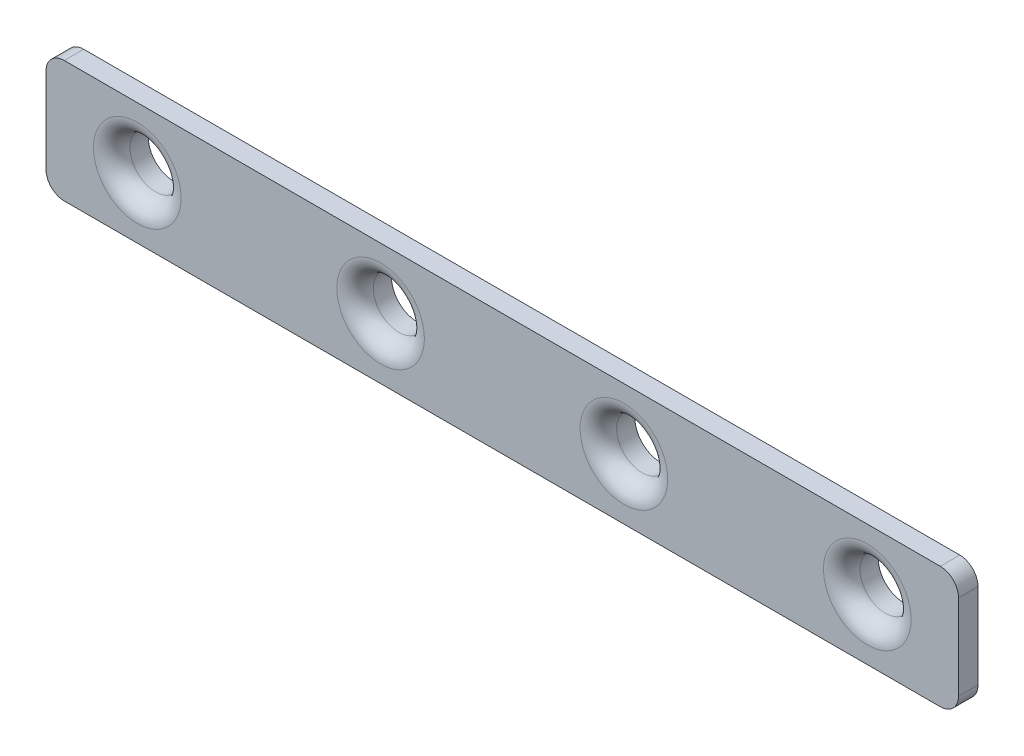
ISO-10303-21;
HEADER;
FILE_DESCRIPTION(('STEP AP214'),'2;1');
FILE_NAME('part.step','',(''),(''),'','','');
FILE_SCHEMA(('AUTOMOTIVE_DESIGN { 1 0 10303 214 1 1 1 1 }'));
ENDSEC;
DATA;
#1=APPLICATION_CONTEXT('core data for automotive mechanical design processes');
#2=APPLICATION_PROTOCOL_DEFINITION('international standard','automotive_design',2000,#1);
#3=PRODUCT_CONTEXT('',#1,'mechanical');
#4=PRODUCT('Part','Part','',(#3));
#5=PRODUCT_RELATED_PRODUCT_CATEGORY('part','',(#4));
#6=PRODUCT_DEFINITION_FORMATION('','',#4);
#7=PRODUCT_DEFINITION_CONTEXT('part definition',#1,'design');
#8=PRODUCT_DEFINITION('design','',#6,#7);
#9=PRODUCT_DEFINITION_SHAPE('','',#8);
#10=(LENGTH_UNIT() NAMED_UNIT(*) SI_UNIT(.MILLI.,.METRE.));
#11=(NAMED_UNIT(*) PLANE_ANGLE_UNIT() SI_UNIT($,.RADIAN.));
#12=(NAMED_UNIT(*) SI_UNIT($,.STERADIAN.) SOLID_ANGLE_UNIT());
#13=UNCERTAINTY_MEASURE_WITH_UNIT(LENGTH_MEASURE(1.E-05),#10,'distance_accuracy_value','');
#14=(GEOMETRIC_REPRESENTATION_CONTEXT(3) GLOBAL_UNCERTAINTY_ASSIGNED_CONTEXT((#13)) GLOBAL_UNIT_ASSIGNED_CONTEXT((#10,
#11,#12)) REPRESENTATION_CONTEXT('',''));
#15=CARTESIAN_POINT('',(0.,0.,0.));
#16=DIRECTION('',(0.,0.,1.));
#17=DIRECTION('',(1.,0.,0.));
#18=AXIS2_PLACEMENT_3D('',#15,#16,#17);
#19=CARTESIAN_POINT('',(36.,-3.5,0.));
#20=DIRECTION('',(0.,0.,1.));
#21=DIRECTION('',(1.,0.,0.));
#22=AXIS2_PLACEMENT_3D('',#19,#20,#21);
#23=PLANE('',#22);
#24=CARTESIAN_POINT('',(30.,0.,0.));
#25=DIRECTION('',(0.,0.,1.));
#26=DIRECTION('',(1.,0.,0.));
#27=AXIS2_PLACEMENT_3D('',#24,#25,#26);
#28=CIRCLE('',#27,4.45);
#29=CARTESIAN_POINT('',(34.45,0.,0.));
#30=VERTEX_POINT('',#29);
#31=EDGE_CURVE('E180',#30,#30,#28,.T.);
#32=ORIENTED_EDGE('',*,*,#31,.T.);
#33=EDGE_LOOP('',(#32));
#34=FACE_BOUND('',#33,.T.);
#35=CARTESIAN_POINT('',(10.,0.,0.));
#36=DIRECTION('',(0.,0.,1.));
#37=DIRECTION('',(1.,0.,0.));
#38=AXIS2_PLACEMENT_3D('',#35,#36,#37);
#39=CIRCLE('',#38,4.45);
#40=CARTESIAN_POINT('',(14.45,0.,0.));
#41=VERTEX_POINT('',#40);
#42=EDGE_CURVE('E177',#41,#41,#39,.T.);
#43=ORIENTED_EDGE('',*,*,#42,.T.);
#44=EDGE_LOOP('',(#43));
#45=FACE_BOUND('',#44,.T.);
#46=CARTESIAN_POINT('',(-10.,0.,0.));
#47=DIRECTION('',(0.,0.,1.));
#48=DIRECTION('',(1.,0.,0.));
#49=AXIS2_PLACEMENT_3D('',#46,#47,#48);
#50=CIRCLE('',#49,4.45);
#51=CARTESIAN_POINT('',(-5.55,0.,0.));
#52=VERTEX_POINT('',#51);
#53=EDGE_CURVE('E174',#52,#52,#50,.T.);
#54=ORIENTED_EDGE('',*,*,#53,.T.);
#55=EDGE_LOOP('',(#54));
#56=FACE_BOUND('',#55,.T.);
#57=CARTESIAN_POINT('',(-30.,0.,0.));
#58=DIRECTION('',(0.,0.,1.));
#59=DIRECTION('',(1.,0.,0.));
#60=AXIS2_PLACEMENT_3D('',#57,#58,#59);
#61=CIRCLE('',#60,4.45);
#62=CARTESIAN_POINT('',(-25.55,0.,0.));
#63=VERTEX_POINT('',#62);
#64=EDGE_CURVE('E171',#63,#63,#61,.T.);
#65=ORIENTED_EDGE('',*,*,#64,.T.);
#66=EDGE_LOOP('',(#65));
#67=FACE_BOUND('',#66,.T.);
#68=CARTESIAN_POINT('',(36.,-3.5,0.));
#69=DIRECTION('',(0.,0.,1.));
#70=DIRECTION('',(1.,0.,0.));
#71=AXIS2_PLACEMENT_3D('',#68,#69,#70);
#72=CIRCLE('',#71,1.50000000000001);
#73=CARTESIAN_POINT('',(36.,-5.,0.));
#74=VERTEX_POINT('',#73);
#75=CARTESIAN_POINT('',(37.5,-3.5,0.));
#76=VERTEX_POINT('',#75);
#77=EDGE_CURVE('E114',#74,#76,#72,.T.);
#78=ORIENTED_EDGE('',*,*,#77,.F.);
#79=DIRECTION('',(1.,0.,0.));
#80=VECTOR('',#79,1.);
#81=CARTESIAN_POINT('',(-36.,-5.,0.));
#82=LINE('',#81,#80);
#83=CARTESIAN_POINT('',(-36.,-5.,0.));
#84=VERTEX_POINT('',#83);
#85=EDGE_CURVE('E68',#84,#74,#82,.T.);
#86=ORIENTED_EDGE('',*,*,#85,.F.);
#87=CARTESIAN_POINT('',(-36.,-3.5,0.));
#88=DIRECTION('',(0.,0.,1.));
#89=DIRECTION('',(1.,0.,0.));
#90=AXIS2_PLACEMENT_3D('',#87,#88,#89);
#91=CIRCLE('',#90,1.5);
#92=CARTESIAN_POINT('',(-37.5,-3.49999999999999,0.));
#93=VERTEX_POINT('',#92);
#94=EDGE_CURVE('E62',#93,#84,#91,.T.);
#95=ORIENTED_EDGE('',*,*,#94,.F.);
#96=DIRECTION('',(0.,-1.,0.));
#97=VECTOR('',#96,1.);
#98=CARTESIAN_POINT('',(-37.5,3.49999999999999,0.));
#99=LINE('',#98,#97);
#100=CARTESIAN_POINT('',(-37.5,3.49999999999999,0.));
#101=VERTEX_POINT('',#100);
#102=EDGE_CURVE('E104',#101,#93,#99,.T.);
#103=ORIENTED_EDGE('',*,*,#102,.F.);
#104=CARTESIAN_POINT('',(-36.,3.5,0.));
#105=DIRECTION('',(0.,0.,1.));
#106=DIRECTION('',(1.,0.,0.));
#107=AXIS2_PLACEMENT_3D('',#104,#105,#106);
#108=CIRCLE('',#107,1.5);
#109=CARTESIAN_POINT('',(-36.,5.,0.));
#110=VERTEX_POINT('',#109);
#111=EDGE_CURVE('E124',#110,#101,#108,.T.);
#112=ORIENTED_EDGE('',*,*,#111,.F.);
#113=DIRECTION('',(-1.,0.,0.));
#114=VECTOR('',#113,1.);
#115=CARTESIAN_POINT('',(36.,5.,0.));
#116=LINE('',#115,#114);
#117=CARTESIAN_POINT('',(36.,5.,0.));
#118=VERTEX_POINT('',#117);
#119=EDGE_CURVE('E122',#118,#110,#116,.T.);
#120=ORIENTED_EDGE('',*,*,#119,.F.);
#121=CARTESIAN_POINT('',(36.,3.5,0.));
#122=DIRECTION('',(0.,0.,1.));
#123=DIRECTION('',(1.,0.,0.));
#124=AXIS2_PLACEMENT_3D('',#121,#122,#123);
#125=CIRCLE('',#124,1.50000000000001);
#126=CARTESIAN_POINT('',(37.5,3.5,0.));
#127=VERTEX_POINT('',#126);
#128=EDGE_CURVE('E120',#127,#118,#125,.T.);
#129=ORIENTED_EDGE('',*,*,#128,.F.);
#130=DIRECTION('',(0.,1.,0.));
#131=VECTOR('',#130,1.);
#132=CARTESIAN_POINT('',(37.5,-3.5,0.));
#133=LINE('',#132,#131);
#134=EDGE_CURVE('E117',#76,#127,#133,.T.);
#135=ORIENTED_EDGE('',*,*,#134,.F.);
#136=EDGE_LOOP('',(#78,#86,#95,#103,#112,#120,#129,#135));
#137=FACE_BOUND('',#136,.T.);
#138=ADVANCED_FACE('F16',(#34,#45,#56,#67,#137),#23,.F.);
#139=CARTESIAN_POINT('',(36.,-3.5,1.6));
#140=DIRECTION('',(0.,0.,1.));
#141=DIRECTION('',(1.,0.,0.));
#142=AXIS2_PLACEMENT_3D('',#139,#140,#141);
#143=PLANE('',#142);
#144=CARTESIAN_POINT('',(30.,0.,1.6));
#145=DIRECTION('',(0.,0.,1.));
#146=DIRECTION('',(1.,0.,0.));
#147=AXIS2_PLACEMENT_3D('',#144,#145,#146);
#148=CIRCLE('',#147,3.6);
#149=CARTESIAN_POINT('',(33.6,0.,1.6));
#150=VERTEX_POINT('',#149);
#151=EDGE_CURVE('E156',#150,#150,#148,.F.);
#152=ORIENTED_EDGE('',*,*,#151,.T.);
#153=EDGE_LOOP('',(#152));
#154=FACE_BOUND('',#153,.T.);
#155=CARTESIAN_POINT('',(10.,0.,1.6));
#156=DIRECTION('',(0.,0.,1.));
#157=DIRECTION('',(1.,0.,0.));
#158=AXIS2_PLACEMENT_3D('',#155,#156,#157);
#159=CIRCLE('',#158,3.6);
#160=CARTESIAN_POINT('',(13.6,0.,1.6));
#161=VERTEX_POINT('',#160);
#162=EDGE_CURVE('E153',#161,#161,#159,.F.);
#163=ORIENTED_EDGE('',*,*,#162,.T.);
#164=EDGE_LOOP('',(#163));
#165=FACE_BOUND('',#164,.T.);
#166=CARTESIAN_POINT('',(-10.,0.,1.6));
#167=DIRECTION('',(0.,0.,1.));
#168=DIRECTION('',(1.,0.,0.));
#169=AXIS2_PLACEMENT_3D('',#166,#167,#168);
#170=CIRCLE('',#169,3.6);
#171=CARTESIAN_POINT('',(-6.4,0.,1.6));
#172=VERTEX_POINT('',#171);
#173=EDGE_CURVE('E150',#172,#172,#170,.F.);
#174=ORIENTED_EDGE('',*,*,#173,.T.);
#175=EDGE_LOOP('',(#174));
#176=FACE_BOUND('',#175,.T.);
#177=CARTESIAN_POINT('',(-30.,0.,1.6));
#178=DIRECTION('',(0.,0.,1.));
#179=DIRECTION('',(1.,0.,0.));
#180=AXIS2_PLACEMENT_3D('',#177,#178,#179);
#181=CIRCLE('',#180,3.6);
#182=CARTESIAN_POINT('',(-26.4,0.,1.6));
#183=VERTEX_POINT('',#182);
#184=EDGE_CURVE('E147',#183,#183,#181,.F.);
#185=ORIENTED_EDGE('',*,*,#184,.T.);
#186=EDGE_LOOP('',(#185));
#187=FACE_BOUND('',#186,.T.);
#188=CARTESIAN_POINT('',(36.,-3.5,1.6));
#189=DIRECTION('',(0.,0.,1.));
#190=DIRECTION('',(1.,0.,0.));
#191=AXIS2_PLACEMENT_3D('',#188,#189,#190);
#192=CIRCLE('',#191,1.50000000000001);
#193=CARTESIAN_POINT('',(36.,-5.,1.6));
#194=VERTEX_POINT('',#193);
#195=CARTESIAN_POINT('',(37.5,-3.5,1.6));
#196=VERTEX_POINT('',#195);
#197=EDGE_CURVE('E129',#194,#196,#192,.T.);
#198=ORIENTED_EDGE('',*,*,#197,.T.);
#199=DIRECTION('',(0.,1.,0.));
#200=VECTOR('',#199,1.);
#201=CARTESIAN_POINT('',(37.5,-3.5,1.6));
#202=LINE('',#201,#200);
#203=CARTESIAN_POINT('',(37.5,3.5,1.6));
#204=VERTEX_POINT('',#203);
#205=EDGE_CURVE('E77',#196,#204,#202,.T.);
#206=ORIENTED_EDGE('',*,*,#205,.T.);
#207=CARTESIAN_POINT('',(36.,3.5,1.6));
#208=DIRECTION('',(0.,0.,1.));
#209=DIRECTION('',(1.,0.,0.));
#210=AXIS2_PLACEMENT_3D('',#207,#208,#209);
#211=CIRCLE('',#210,1.50000000000001);
#212=CARTESIAN_POINT('',(36.,5.,1.6));
#213=VERTEX_POINT('',#212);
#214=EDGE_CURVE('E286',#204,#213,#211,.T.);
#215=ORIENTED_EDGE('',*,*,#214,.T.);
#216=DIRECTION('',(-1.,0.,0.));
#217=VECTOR('',#216,1.);
#218=CARTESIAN_POINT('',(36.,5.,1.6));
#219=LINE('',#218,#217);
#220=CARTESIAN_POINT('',(-36.,5.,1.6));
#221=VERTEX_POINT('',#220);
#222=EDGE_CURVE('E288',#213,#221,#219,.T.);
#223=ORIENTED_EDGE('',*,*,#222,.T.);
#224=CARTESIAN_POINT('',(-36.,3.5,1.6));
#225=DIRECTION('',(0.,0.,1.));
#226=DIRECTION('',(1.,0.,0.));
#227=AXIS2_PLACEMENT_3D('',#224,#225,#226);
#228=CIRCLE('',#227,1.5);
#229=CARTESIAN_POINT('',(-37.5,3.49999999999999,1.6));
#230=VERTEX_POINT('',#229);
#231=EDGE_CURVE('E96',#221,#230,#228,.T.);
#232=ORIENTED_EDGE('',*,*,#231,.T.);
#233=DIRECTION('',(0.,-1.,0.));
#234=VECTOR('',#233,1.);
#235=CARTESIAN_POINT('',(-37.5,3.49999999999999,1.6));
#236=LINE('',#235,#234);
#237=CARTESIAN_POINT('',(-37.5,-3.49999999999999,1.6));
#238=VERTEX_POINT('',#237);
#239=EDGE_CURVE('E90',#230,#238,#236,.T.);
#240=ORIENTED_EDGE('',*,*,#239,.T.);
#241=CARTESIAN_POINT('',(-36.,-3.5,1.6));
#242=DIRECTION('',(0.,0.,1.));
#243=DIRECTION('',(1.,0.,0.));
#244=AXIS2_PLACEMENT_3D('',#241,#242,#243);
#245=CIRCLE('',#244,1.5);
#246=CARTESIAN_POINT('',(-36.,-5.,1.6));
#247=VERTEX_POINT('',#246);
#248=EDGE_CURVE('E94',#238,#247,#245,.T.);
#249=ORIENTED_EDGE('',*,*,#248,.T.);
#250=DIRECTION('',(1.,0.,0.));
#251=VECTOR('',#250,1.);
#252=CARTESIAN_POINT('',(-36.,-5.,1.6));
#253=LINE('',#252,#251);
#254=EDGE_CURVE('E33',#247,#194,#253,.T.);
#255=ORIENTED_EDGE('',*,*,#254,.T.);
#256=EDGE_LOOP('',(#198,#206,#215,#223,#232,#240,#249,#255));
#257=FACE_BOUND('',#256,.T.);
#258=ADVANCED_FACE('F92',(#154,#165,#176,#187,#257),#143,.T.);
#259=CARTESIAN_POINT('',(36.,-3.5,1.6));
#260=DIRECTION('',(0.,0.,-1.));
#261=DIRECTION('',(-1.,0.,0.));
#262=AXIS2_PLACEMENT_3D('',#259,#260,#261);
#263=CYLINDRICAL_SURFACE('',#262,1.50000000000001);
#264=ORIENTED_EDGE('',*,*,#77,.T.);
#265=DIRECTION('',(0.,0.,-1.));
#266=VECTOR('',#265,1.);
#267=CARTESIAN_POINT('',(37.5,-3.5,1.6));
#268=LINE('',#267,#266);
#269=EDGE_CURVE('E142',#196,#76,#268,.T.);
#270=ORIENTED_EDGE('',*,*,#269,.F.);
#271=ORIENTED_EDGE('',*,*,#197,.F.);
#272=DIRECTION('',(0.,0.,-1.));
#273=VECTOR('',#272,1.);
#274=CARTESIAN_POINT('',(36.,-5.,1.6));
#275=LINE('',#274,#273);
#276=EDGE_CURVE('E110',#194,#74,#275,.T.);
#277=ORIENTED_EDGE('',*,*,#276,.T.);
#278=EDGE_LOOP('',(#264,#270,#271,#277));
#279=FACE_BOUND('',#278,.T.);
#280=ADVANCED_FACE('F211',(#279),#263,.T.);
#281=CARTESIAN_POINT('',(37.5,-3.5,1.6));
#282=DIRECTION('',(-1.,0.,0.));
#283=DIRECTION('',(0.,0.,1.));
#284=AXIS2_PLACEMENT_3D('',#281,#282,#283);
#285=PLANE('',#284);
#286=ORIENTED_EDGE('',*,*,#134,.T.);
#287=DIRECTION('',(0.,0.,-1.));
#288=VECTOR('',#287,1.);
#289=CARTESIAN_POINT('',(37.5,3.5,1.6));
#290=LINE('',#289,#288);
#291=EDGE_CURVE('E139',#204,#127,#290,.T.);
#292=ORIENTED_EDGE('',*,*,#291,.F.);
#293=ORIENTED_EDGE('',*,*,#205,.F.);
#294=ORIENTED_EDGE('',*,*,#269,.T.);
#295=EDGE_LOOP('',(#286,#292,#293,#294));
#296=FACE_BOUND('',#295,.T.);
#297=ADVANCED_FACE('F236',(#296),#285,.F.);
#298=CARTESIAN_POINT('',(36.,3.5,1.6));
#299=DIRECTION('',(0.,0.,-1.));
#300=DIRECTION('',(-1.,0.,0.));
#301=AXIS2_PLACEMENT_3D('',#298,#299,#300);
#302=CYLINDRICAL_SURFACE('',#301,1.50000000000001);
#303=ORIENTED_EDGE('',*,*,#128,.T.);
#304=DIRECTION('',(0.,0.,-1.));
#305=VECTOR('',#304,1.);
#306=CARTESIAN_POINT('',(36.,5.,1.6));
#307=LINE('',#306,#305);
#308=EDGE_CURVE('E136',#213,#118,#307,.T.);
#309=ORIENTED_EDGE('',*,*,#308,.F.);
#310=ORIENTED_EDGE('',*,*,#214,.F.);
#311=ORIENTED_EDGE('',*,*,#291,.T.);
#312=EDGE_LOOP('',(#303,#309,#310,#311));
#313=FACE_BOUND('',#312,.T.);
#314=ADVANCED_FACE('F232',(#313),#302,.T.);
#315=CARTESIAN_POINT('',(36.,5.,1.6));
#316=DIRECTION('',(0.,-1.,0.));
#317=DIRECTION('',(0.,0.,-1.));
#318=AXIS2_PLACEMENT_3D('',#315,#316,#317);
#319=PLANE('',#318);
#320=ORIENTED_EDGE('',*,*,#119,.T.);
#321=DIRECTION('',(0.,0.,-1.));
#322=VECTOR('',#321,1.);
#323=CARTESIAN_POINT('',(-36.,5.,1.6));
#324=LINE('',#323,#322);
#325=EDGE_CURVE('E133',#221,#110,#324,.T.);
#326=ORIENTED_EDGE('',*,*,#325,.F.);
#327=ORIENTED_EDGE('',*,*,#222,.F.);
#328=ORIENTED_EDGE('',*,*,#308,.T.);
#329=EDGE_LOOP('',(#320,#326,#327,#328));
#330=FACE_BOUND('',#329,.T.);
#331=ADVANCED_FACE('F228',(#330),#319,.F.);
#332=CARTESIAN_POINT('',(-36.,3.5,1.6));
#333=DIRECTION('',(0.,0.,-1.));
#334=DIRECTION('',(-1.,0.,0.));
#335=AXIS2_PLACEMENT_3D('',#332,#333,#334);
#336=CYLINDRICAL_SURFACE('',#335,1.5);
#337=ORIENTED_EDGE('',*,*,#111,.T.);
#338=DIRECTION('',(0.,0.,-1.));
#339=VECTOR('',#338,1.);
#340=CARTESIAN_POINT('',(-37.5,3.49999999999999,1.6));
#341=LINE('',#340,#339);
#342=EDGE_CURVE('E105',#230,#101,#341,.T.);
#343=ORIENTED_EDGE('',*,*,#342,.F.);
#344=ORIENTED_EDGE('',*,*,#231,.F.);
#345=ORIENTED_EDGE('',*,*,#325,.T.);
#346=EDGE_LOOP('',(#337,#343,#344,#345));
#347=FACE_BOUND('',#346,.T.);
#348=ADVANCED_FACE('F225',(#347),#336,.T.);
#349=CARTESIAN_POINT('',(-37.5,3.49999999999999,1.6));
#350=DIRECTION('',(1.,0.,0.));
#351=DIRECTION('',(0.,0.,-1.));
#352=AXIS2_PLACEMENT_3D('',#349,#350,#351);
#353=PLANE('',#352);
#354=ORIENTED_EDGE('',*,*,#102,.T.);
#355=DIRECTION('',(0.,0.,-1.));
#356=VECTOR('',#355,1.);
#357=CARTESIAN_POINT('',(-37.5,-3.49999999999999,1.6));
#358=LINE('',#357,#356);
#359=EDGE_CURVE('E101',#238,#93,#358,.T.);
#360=ORIENTED_EDGE('',*,*,#359,.F.);
#361=ORIENTED_EDGE('',*,*,#239,.F.);
#362=ORIENTED_EDGE('',*,*,#342,.T.);
#363=EDGE_LOOP('',(#354,#360,#361,#362));
#364=FACE_BOUND('',#363,.T.);
#365=ADVANCED_FACE('F102',(#364),#353,.F.);
#366=CARTESIAN_POINT('',(-36.,-3.5,1.6));
#367=DIRECTION('',(0.,0.,-1.));
#368=DIRECTION('',(-1.,0.,0.));
#369=AXIS2_PLACEMENT_3D('',#366,#367,#368);
#370=CYLINDRICAL_SURFACE('',#369,1.5);
#371=ORIENTED_EDGE('',*,*,#94,.T.);
#372=DIRECTION('',(0.,0.,-1.));
#373=VECTOR('',#372,1.);
#374=CARTESIAN_POINT('',(-36.,-5.,1.6));
#375=LINE('',#374,#373);
#376=EDGE_CURVE('E106',#247,#84,#375,.T.);
#377=ORIENTED_EDGE('',*,*,#376,.F.);
#378=ORIENTED_EDGE('',*,*,#248,.F.);
#379=ORIENTED_EDGE('',*,*,#359,.T.);
#380=EDGE_LOOP('',(#371,#377,#378,#379));
#381=FACE_BOUND('',#380,.T.);
#382=ADVANCED_FACE('F108',(#381),#370,.T.);
#383=CARTESIAN_POINT('',(-36.,-5.,1.6));
#384=DIRECTION('',(0.,1.,0.));
#385=DIRECTION('',(0.,0.,1.));
#386=AXIS2_PLACEMENT_3D('',#383,#384,#385);
#387=PLANE('',#386);
#388=ORIENTED_EDGE('',*,*,#85,.T.);
#389=ORIENTED_EDGE('',*,*,#276,.F.);
#390=ORIENTED_EDGE('',*,*,#254,.F.);
#391=ORIENTED_EDGE('',*,*,#376,.T.);
#392=EDGE_LOOP('',(#388,#389,#390,#391));
#393=FACE_BOUND('',#392,.T.);
#394=ADVANCED_FACE('F217',(#393),#387,.F.);
#395=CARTESIAN_POINT('',(10.,0.,1.6));
#396=DIRECTION('',(0.,0.,-1.));
#397=DIRECTION('',(-1.,0.,0.));
#398=AXIS2_PLACEMENT_3D('',#395,#396,#397);
#399=CYLINDRICAL_SURFACE('',#398,2.1);
#400=CARTESIAN_POINT('',(10.,0.,0.1));
#401=DIRECTION('',(0.,0.,1.));
#402=DIRECTION('',(1.,0.,0.));
#403=AXIS2_PLACEMENT_3D('',#400,#401,#402);
#404=CIRCLE('',#403,2.1);
#405=CARTESIAN_POINT('',(12.1,0.,0.1));
#406=VERTEX_POINT('',#405);
#407=EDGE_CURVE('E159',#406,#406,#404,.T.);
#408=ORIENTED_EDGE('',*,*,#407,.T.);
#409=EDGE_LOOP('',(#408));
#410=FACE_BOUND('',#409,.T.);
#411=CARTESIAN_POINT('',(10.,0.,-1.4));
#412=DIRECTION('',(0.,0.,-1.));
#413=DIRECTION('',(-1.,0.,0.));
#414=AXIS2_PLACEMENT_3D('',#411,#412,#413);
#415=CIRCLE('',#414,2.1);
#416=CARTESIAN_POINT('',(7.9,0.,-1.4));
#417=VERTEX_POINT('',#416);
#418=EDGE_CURVE('E302',#417,#417,#415,.T.);
#419=ORIENTED_EDGE('',*,*,#418,.T.);
#420=EDGE_LOOP('',(#419));
#421=FACE_BOUND('',#420,.T.);
#422=ADVANCED_FACE('F220',(#410,#421),#399,.F.);
#423=CARTESIAN_POINT('',(30.,0.,1.6));
#424=DIRECTION('',(0.,0.,-1.));
#425=DIRECTION('',(-1.,0.,0.));
#426=AXIS2_PLACEMENT_3D('',#423,#424,#425);
#427=CYLINDRICAL_SURFACE('',#426,2.1);
#428=CARTESIAN_POINT('',(30.,0.,0.1));
#429=DIRECTION('',(0.,0.,1.));
#430=DIRECTION('',(1.,0.,0.));
#431=AXIS2_PLACEMENT_3D('',#428,#429,#430);
#432=CIRCLE('',#431,2.1);
#433=CARTESIAN_POINT('',(32.1,0.,0.1));
#434=VERTEX_POINT('',#433);
#435=EDGE_CURVE('E144',#434,#434,#432,.T.);
#436=ORIENTED_EDGE('',*,*,#435,.T.);
#437=EDGE_LOOP('',(#436));
#438=FACE_BOUND('',#437,.T.);
#439=CARTESIAN_POINT('',(30.,0.,-1.4));
#440=DIRECTION('',(0.,0.,-1.));
#441=DIRECTION('',(-1.,0.,0.));
#442=AXIS2_PLACEMENT_3D('',#439,#440,#441);
#443=CIRCLE('',#442,2.1);
#444=CARTESIAN_POINT('',(27.9,0.,-1.4));
#445=VERTEX_POINT('',#444);
#446=EDGE_CURVE('E277',#445,#445,#443,.T.);
#447=ORIENTED_EDGE('',*,*,#446,.T.);
#448=EDGE_LOOP('',(#447));
#449=FACE_BOUND('',#448,.T.);
#450=ADVANCED_FACE('F351',(#438,#449),#427,.F.);
#451=CARTESIAN_POINT('',(-10.,0.,1.6));
#452=DIRECTION('',(0.,0.,-1.));
#453=DIRECTION('',(-1.,0.,0.));
#454=AXIS2_PLACEMENT_3D('',#451,#452,#453);
#455=CYLINDRICAL_SURFACE('',#454,2.1);
#456=CARTESIAN_POINT('',(-10.,0.,0.1));
#457=DIRECTION('',(0.,0.,1.));
#458=DIRECTION('',(1.,0.,0.));
#459=AXIS2_PLACEMENT_3D('',#456,#457,#458);
#460=CIRCLE('',#459,2.1);
#461=CARTESIAN_POINT('',(-7.9,0.,0.1));
#462=VERTEX_POINT('',#461);
#463=EDGE_CURVE('E162',#462,#462,#460,.T.);
#464=ORIENTED_EDGE('',*,*,#463,.T.);
#465=EDGE_LOOP('',(#464));
#466=FACE_BOUND('',#465,.T.);
#467=CARTESIAN_POINT('',(-10.,0.,-1.4));
#468=DIRECTION('',(0.,0.,-1.));
#469=DIRECTION('',(-1.,0.,0.));
#470=AXIS2_PLACEMENT_3D('',#467,#468,#469);
#471=CIRCLE('',#470,2.1);
#472=CARTESIAN_POINT('',(-12.1,0.,-1.4));
#473=VERTEX_POINT('',#472);
#474=EDGE_CURVE('E308',#473,#473,#471,.T.);
#475=ORIENTED_EDGE('',*,*,#474,.T.);
#476=EDGE_LOOP('',(#475));
#477=FACE_BOUND('',#476,.T.);
#478=ADVANCED_FACE('F347',(#466,#477),#455,.F.);
#479=CARTESIAN_POINT('',(-30.,0.,1.6));
#480=DIRECTION('',(0.,0.,-1.));
#481=DIRECTION('',(-1.,0.,0.));
#482=AXIS2_PLACEMENT_3D('',#479,#480,#481);
#483=CYLINDRICAL_SURFACE('',#482,2.1);
#484=CARTESIAN_POINT('',(-30.,0.,0.1));
#485=DIRECTION('',(0.,0.,1.));
#486=DIRECTION('',(1.,0.,0.));
#487=AXIS2_PLACEMENT_3D('',#484,#485,#486);
#488=CIRCLE('',#487,2.1);
#489=CARTESIAN_POINT('',(-27.9,0.,0.1));
#490=VERTEX_POINT('',#489);
#491=EDGE_CURVE('E165',#490,#490,#488,.T.);
#492=ORIENTED_EDGE('',*,*,#491,.T.);
#493=EDGE_LOOP('',(#492));
#494=FACE_BOUND('',#493,.T.);
#495=CARTESIAN_POINT('',(-30.,0.,-1.4));
#496=DIRECTION('',(0.,0.,-1.));
#497=DIRECTION('',(-1.,0.,0.));
#498=AXIS2_PLACEMENT_3D('',#495,#496,#497);
#499=CIRCLE('',#498,2.1);
#500=CARTESIAN_POINT('',(-32.1,0.,-1.4));
#501=VERTEX_POINT('',#500);
#502=EDGE_CURVE('E314',#501,#501,#499,.T.);
#503=ORIENTED_EDGE('',*,*,#502,.T.);
#504=EDGE_LOOP('',(#503));
#505=FACE_BOUND('',#504,.T.);
#506=ADVANCED_FACE('F318',(#494,#505),#483,.F.);
#507=CARTESIAN_POINT('',(30.,0.,-1.4));
#508=DIRECTION('',(0.,0.,-1.));
#509=DIRECTION('',(-1.,0.,0.));
#510=AXIS2_PLACEMENT_3D('',#507,#508,#509);
#511=PLANE('',#510);
#512=CARTESIAN_POINT('',(30.,0.,-1.4));
#513=DIRECTION('',(0.,0.,-1.));
#514=DIRECTION('',(-1.,0.,0.));
#515=AXIS2_PLACEMENT_3D('',#512,#513,#514);
#516=CIRCLE('',#515,3.45);
#517=CARTESIAN_POINT('',(26.55,0.,-1.4));
#518=VERTEX_POINT('',#517);
#519=EDGE_CURVE('E118',#518,#518,#516,.T.);
#520=ORIENTED_EDGE('',*,*,#519,.T.);
#521=EDGE_LOOP('',(#520));
#522=FACE_BOUND('',#521,.T.);
#523=ORIENTED_EDGE('',*,*,#446,.F.);
#524=EDGE_LOOP('',(#523));
#525=FACE_BOUND('',#524,.T.);
#526=ADVANCED_FACE('F272',(#522,#525),#511,.T.);
#527=CARTESIAN_POINT('',(30.,0.,-1.4));
#528=DIRECTION('',(0.,0.,1.));
#529=DIRECTION('',(1.,0.,0.));
#530=AXIS2_PLACEMENT_3D('',#527,#528,#529);
#531=CYLINDRICAL_SURFACE('',#530,3.45);
#532=CARTESIAN_POINT('',(30.,0.,-1.));
#533=DIRECTION('',(0.,0.,1.));
#534=DIRECTION('',(1.,0.,0.));
#535=AXIS2_PLACEMENT_3D('',#532,#533,#534);
#536=CIRCLE('',#535,3.45);
#537=CARTESIAN_POINT('',(33.45,0.,-1.));
#538=VERTEX_POINT('',#537);
#539=EDGE_CURVE('E168',#538,#538,#536,.F.);
#540=ORIENTED_EDGE('',*,*,#539,.T.);
#541=EDGE_LOOP('',(#540));
#542=FACE_BOUND('',#541,.T.);
#543=ORIENTED_EDGE('',*,*,#519,.F.);
#544=EDGE_LOOP('',(#543));
#545=FACE_BOUND('',#544,.T.);
#546=ADVANCED_FACE('F268',(#542,#545),#531,.T.);
#547=CARTESIAN_POINT('',(10.,0.,-1.4));
#548=DIRECTION('',(0.,0.,-1.));
#549=DIRECTION('',(-1.,0.,0.));
#550=AXIS2_PLACEMENT_3D('',#547,#548,#549);
#551=PLANE('',#550);
#552=CARTESIAN_POINT('',(10.,0.,-1.4));
#553=DIRECTION('',(0.,0.,-1.));
#554=DIRECTION('',(-1.,0.,0.));
#555=AXIS2_PLACEMENT_3D('',#552,#553,#554);
#556=CIRCLE('',#555,3.45);
#557=CARTESIAN_POINT('',(6.55,0.,-1.4));
#558=VERTEX_POINT('',#557);
#559=EDGE_CURVE('E280',#558,#558,#556,.T.);
#560=ORIENTED_EDGE('',*,*,#559,.T.);
#561=EDGE_LOOP('',(#560));
#562=FACE_BOUND('',#561,.T.);
#563=ORIENTED_EDGE('',*,*,#418,.F.);
#564=EDGE_LOOP('',(#563));
#565=FACE_BOUND('',#564,.T.);
#566=ADVANCED_FACE('F271',(#562,#565),#551,.T.);
#567=CARTESIAN_POINT('',(10.,0.,-1.4));
#568=DIRECTION('',(0.,0.,1.));
#569=DIRECTION('',(1.,0.,0.));
#570=AXIS2_PLACEMENT_3D('',#567,#568,#569);
#571=CYLINDRICAL_SURFACE('',#570,3.45);
#572=CARTESIAN_POINT('',(10.,0.,-1.));
#573=DIRECTION('',(0.,0.,1.));
#574=DIRECTION('',(1.,0.,0.));
#575=AXIS2_PLACEMENT_3D('',#572,#573,#574);
#576=CIRCLE('',#575,3.45);
#577=CARTESIAN_POINT('',(13.45,0.,-1.));
#578=VERTEX_POINT('',#577);
#579=EDGE_CURVE('E183',#578,#578,#576,.F.);
#580=ORIENTED_EDGE('',*,*,#579,.T.);
#581=EDGE_LOOP('',(#580));
#582=FACE_BOUND('',#581,.T.);
#583=ORIENTED_EDGE('',*,*,#559,.F.);
#584=EDGE_LOOP('',(#583));
#585=FACE_BOUND('',#584,.T.);
#586=ADVANCED_FACE('F334',(#582,#585),#571,.T.);
#587=CARTESIAN_POINT('',(-10.,0.,-1.4));
#588=DIRECTION('',(0.,0.,-1.));
#589=DIRECTION('',(-1.,0.,0.));
#590=AXIS2_PLACEMENT_3D('',#587,#588,#589);
#591=PLANE('',#590);
#592=CARTESIAN_POINT('',(-10.,0.,-1.4));
#593=DIRECTION('',(0.,0.,-1.));
#594=DIRECTION('',(-1.,0.,0.));
#595=AXIS2_PLACEMENT_3D('',#592,#593,#594);
#596=CIRCLE('',#595,3.45);
#597=CARTESIAN_POINT('',(-13.45,0.,-1.4));
#598=VERTEX_POINT('',#597);
#599=EDGE_CURVE('E305',#598,#598,#596,.T.);
#600=ORIENTED_EDGE('',*,*,#599,.T.);
#601=EDGE_LOOP('',(#600));
#602=FACE_BOUND('',#601,.T.);
#603=ORIENTED_EDGE('',*,*,#474,.F.);
#604=EDGE_LOOP('',(#603));
#605=FACE_BOUND('',#604,.T.);
#606=ADVANCED_FACE('F330',(#602,#605),#591,.T.);
#607=CARTESIAN_POINT('',(-10.,0.,-1.4));
#608=DIRECTION('',(0.,0.,1.));
#609=DIRECTION('',(1.,0.,0.));
#610=AXIS2_PLACEMENT_3D('',#607,#608,#609);
#611=CYLINDRICAL_SURFACE('',#610,3.45);
#612=CARTESIAN_POINT('',(-10.,0.,-1.));
#613=DIRECTION('',(0.,0.,1.));
#614=DIRECTION('',(1.,0.,0.));
#615=AXIS2_PLACEMENT_3D('',#612,#613,#614);
#616=CIRCLE('',#615,3.45);
#617=CARTESIAN_POINT('',(-6.55,0.,-1.));
#618=VERTEX_POINT('',#617);
#619=EDGE_CURVE('E25',#618,#618,#616,.F.);
#620=ORIENTED_EDGE('',*,*,#619,.T.);
#621=EDGE_LOOP('',(#620));
#622=FACE_BOUND('',#621,.T.);
#623=ORIENTED_EDGE('',*,*,#599,.F.);
#624=EDGE_LOOP('',(#623));
#625=FACE_BOUND('',#624,.T.);
#626=ADVANCED_FACE('F188',(#622,#625),#611,.T.);
#627=CARTESIAN_POINT('',(-30.,0.,-1.4));
#628=DIRECTION('',(0.,0.,-1.));
#629=DIRECTION('',(-1.,0.,0.));
#630=AXIS2_PLACEMENT_3D('',#627,#628,#629);
#631=PLANE('',#630);
#632=CARTESIAN_POINT('',(-30.,0.,-1.4));
#633=DIRECTION('',(0.,0.,-1.));
#634=DIRECTION('',(-1.,0.,0.));
#635=AXIS2_PLACEMENT_3D('',#632,#633,#634);
#636=CIRCLE('',#635,3.45);
#637=CARTESIAN_POINT('',(-33.45,0.,-1.4));
#638=VERTEX_POINT('',#637);
#639=EDGE_CURVE('E311',#638,#638,#636,.T.);
#640=ORIENTED_EDGE('',*,*,#639,.T.);
#641=EDGE_LOOP('',(#640));
#642=FACE_BOUND('',#641,.T.);
#643=ORIENTED_EDGE('',*,*,#502,.F.);
#644=EDGE_LOOP('',(#643));
#645=FACE_BOUND('',#644,.T.);
#646=ADVANCED_FACE('F320',(#642,#645),#631,.T.);
#647=CARTESIAN_POINT('',(-30.,0.,-1.4));
#648=DIRECTION('',(0.,0.,1.));
#649=DIRECTION('',(1.,0.,0.));
#650=AXIS2_PLACEMENT_3D('',#647,#648,#649);
#651=CYLINDRICAL_SURFACE('',#650,3.45);
#652=CARTESIAN_POINT('',(-30.,0.,-1.));
#653=DIRECTION('',(0.,0.,1.));
#654=DIRECTION('',(1.,0.,0.));
#655=AXIS2_PLACEMENT_3D('',#652,#653,#654);
#656=CIRCLE('',#655,3.45);
#657=CARTESIAN_POINT('',(-26.55,0.,-1.));
#658=VERTEX_POINT('',#657);
#659=EDGE_CURVE('E10',#658,#658,#656,.F.);
#660=ORIENTED_EDGE('',*,*,#659,.T.);
#661=EDGE_LOOP('',(#660));
#662=FACE_BOUND('',#661,.T.);
#663=ORIENTED_EDGE('',*,*,#639,.F.);
#664=EDGE_LOOP('',(#663));
#665=FACE_BOUND('',#664,.T.);
#666=ADVANCED_FACE('F247',(#662,#665),#651,.T.);
#667=CARTESIAN_POINT('',(30.,0.,0.1));
#668=DIRECTION('',(0.,0.,1.));
#669=DIRECTION('',(1.,0.,0.));
#670=AXIS2_PLACEMENT_3D('',#667,#668,#669);
#671=TOROIDAL_SURFACE('',#670,3.6,1.5);
#672=ORIENTED_EDGE('',*,*,#151,.F.);
#673=EDGE_LOOP('',(#672));
#674=FACE_BOUND('',#673,.T.);
#675=ORIENTED_EDGE('',*,*,#435,.F.);
#676=EDGE_LOOP('',(#675));
#677=FACE_BOUND('',#676,.T.);
#678=ADVANCED_FACE('F243',(#674,#677),#671,.T.);
#679=CARTESIAN_POINT('',(10.,0.,0.1));
#680=DIRECTION('',(0.,0.,1.));
#681=DIRECTION('',(1.,0.,0.));
#682=AXIS2_PLACEMENT_3D('',#679,#680,#681);
#683=TOROIDAL_SURFACE('',#682,3.6,1.5);
#684=ORIENTED_EDGE('',*,*,#162,.F.);
#685=EDGE_LOOP('',(#684));
#686=FACE_BOUND('',#685,.T.);
#687=ORIENTED_EDGE('',*,*,#407,.F.);
#688=EDGE_LOOP('',(#687));
#689=FACE_BOUND('',#688,.T.);
#690=ADVANCED_FACE('F246',(#686,#689),#683,.T.);
#691=CARTESIAN_POINT('',(-10.,0.,0.1));
#692=DIRECTION('',(0.,0.,1.));
#693=DIRECTION('',(1.,0.,0.));
#694=AXIS2_PLACEMENT_3D('',#691,#692,#693);
#695=TOROIDAL_SURFACE('',#694,3.6,1.5);
#696=ORIENTED_EDGE('',*,*,#173,.F.);
#697=EDGE_LOOP('',(#696));
#698=FACE_BOUND('',#697,.T.);
#699=ORIENTED_EDGE('',*,*,#463,.F.);
#700=EDGE_LOOP('',(#699));
#701=FACE_BOUND('',#700,.T.);
#702=ADVANCED_FACE('F251',(#698,#701),#695,.T.);
#703=CARTESIAN_POINT('',(-30.,0.,0.1));
#704=DIRECTION('',(0.,0.,1.));
#705=DIRECTION('',(1.,0.,0.));
#706=AXIS2_PLACEMENT_3D('',#703,#704,#705);
#707=TOROIDAL_SURFACE('',#706,3.6,1.5);
#708=ORIENTED_EDGE('',*,*,#184,.F.);
#709=EDGE_LOOP('',(#708));
#710=FACE_BOUND('',#709,.T.);
#711=ORIENTED_EDGE('',*,*,#491,.F.);
#712=EDGE_LOOP('',(#711));
#713=FACE_BOUND('',#712,.T.);
#714=ADVANCED_FACE('F255',(#710,#713),#707,.T.);
#715=CARTESIAN_POINT('',(30.,0.,-1.));
#716=DIRECTION('',(0.,0.,1.));
#717=DIRECTION('',(1.,0.,0.));
#718=AXIS2_PLACEMENT_3D('',#715,#716,#717);
#719=TOROIDAL_SURFACE('',#718,4.45,1.);
#720=ORIENTED_EDGE('',*,*,#31,.F.);
#721=EDGE_LOOP('',(#720));
#722=FACE_BOUND('',#721,.T.);
#723=ORIENTED_EDGE('',*,*,#539,.F.);
#724=EDGE_LOOP('',(#723));
#725=FACE_BOUND('',#724,.T.);
#726=ADVANCED_FACE('F201',(#722,#725),#719,.F.);
#727=CARTESIAN_POINT('',(10.,0.,-1.));
#728=DIRECTION('',(0.,0.,1.));
#729=DIRECTION('',(1.,0.,0.));
#730=AXIS2_PLACEMENT_3D('',#727,#728,#729);
#731=TOROIDAL_SURFACE('',#730,4.45,1.);
#732=ORIENTED_EDGE('',*,*,#42,.F.);
#733=EDGE_LOOP('',(#732));
#734=FACE_BOUND('',#733,.T.);
#735=ORIENTED_EDGE('',*,*,#579,.F.);
#736=EDGE_LOOP('',(#735));
#737=FACE_BOUND('',#736,.T.);
#738=ADVANCED_FACE('F193',(#734,#737),#731,.F.);
#739=CARTESIAN_POINT('',(-10.,0.,-1.));
#740=DIRECTION('',(0.,0.,1.));
#741=DIRECTION('',(1.,0.,0.));
#742=AXIS2_PLACEMENT_3D('',#739,#740,#741);
#743=TOROIDAL_SURFACE('',#742,4.45,1.);
#744=ORIENTED_EDGE('',*,*,#53,.F.);
#745=EDGE_LOOP('',(#744));
#746=FACE_BOUND('',#745,.T.);
#747=ORIENTED_EDGE('',*,*,#619,.F.);
#748=EDGE_LOOP('',(#747));
#749=FACE_BOUND('',#748,.T.);
#750=ADVANCED_FACE('F191',(#746,#749),#743,.F.);
#751=CARTESIAN_POINT('',(-30.,0.,-1.));
#752=DIRECTION('',(0.,0.,1.));
#753=DIRECTION('',(1.,0.,0.));
#754=AXIS2_PLACEMENT_3D('',#751,#752,#753);
#755=TOROIDAL_SURFACE('',#754,4.45,1.);
#756=ORIENTED_EDGE('',*,*,#64,.F.);
#757=EDGE_LOOP('',(#756));
#758=FACE_BOUND('',#757,.T.);
#759=ORIENTED_EDGE('',*,*,#659,.F.);
#760=EDGE_LOOP('',(#759));
#761=FACE_BOUND('',#760,.T.);
#762=ADVANCED_FACE('F18',(#758,#761),#755,.F.);
#763=CLOSED_SHELL('',(#138,#258,#280,#297,#314,#331,#348,#365,#382,#394,#422,#450,#478,#506,
#526,#546,#566,#586,#606,#626,#646,#666,#678,#690,#702,#714,#726,#738,#750,#762));
#764=MANIFOLD_SOLID_BREP('B1',#763);
#765=ADVANCED_BREP_SHAPE_REPRESENTATION('',(#18,#764),#14);
#766=SHAPE_DEFINITION_REPRESENTATION(#9,#765);
ENDSEC;
END-ISO-10303-21;
